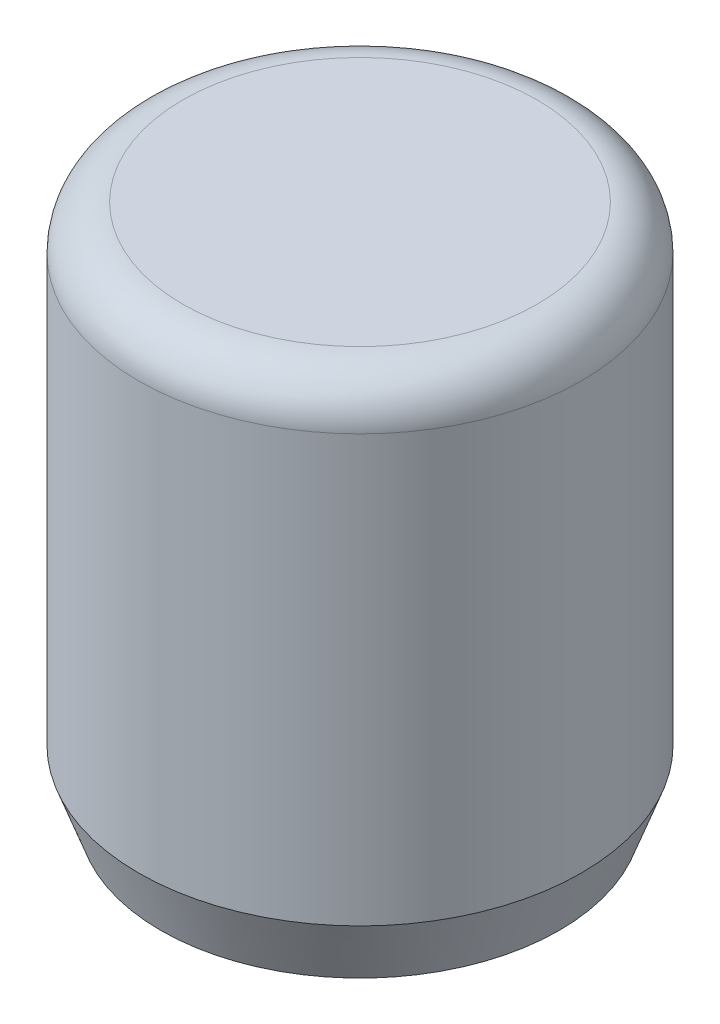
ISO-10303-21;
HEADER;
FILE_DESCRIPTION(('STEP AP214'),'2;1');
FILE_NAME('part.step','',(''),(''),'','','');
FILE_SCHEMA(('AUTOMOTIVE_DESIGN { 1 0 10303 214 1 1 1 1 }'));
ENDSEC;
DATA;
#1=APPLICATION_CONTEXT('core data for automotive mechanical design processes');
#2=APPLICATION_PROTOCOL_DEFINITION('international standard','automotive_design',2000,#1);
#3=PRODUCT_CONTEXT('',#1,'mechanical');
#4=PRODUCT('Part','Part','',(#3));
#5=PRODUCT_RELATED_PRODUCT_CATEGORY('part','',(#4));
#6=PRODUCT_DEFINITION_FORMATION('','',#4);
#7=PRODUCT_DEFINITION_CONTEXT('part definition',#1,'design');
#8=PRODUCT_DEFINITION('design','',#6,#7);
#9=PRODUCT_DEFINITION_SHAPE('','',#8);
#10=(LENGTH_UNIT() NAMED_UNIT(*) SI_UNIT(.MILLI.,.METRE.));
#11=(NAMED_UNIT(*) PLANE_ANGLE_UNIT() SI_UNIT($,.RADIAN.));
#12=(NAMED_UNIT(*) SI_UNIT($,.STERADIAN.) SOLID_ANGLE_UNIT());
#13=UNCERTAINTY_MEASURE_WITH_UNIT(LENGTH_MEASURE(1.E-05),#10,'distance_accuracy_value','');
#14=(GEOMETRIC_REPRESENTATION_CONTEXT(3) GLOBAL_UNCERTAINTY_ASSIGNED_CONTEXT((#13)) GLOBAL_UNIT_ASSIGNED_CONTEXT((#10,
#11,#12)) REPRESENTATION_CONTEXT('',''));
#15=CARTESIAN_POINT('',(0.,0.,0.));
#16=DIRECTION('',(0.,0.,1.));
#17=DIRECTION('',(1.,0.,0.));
#18=AXIS2_PLACEMENT_3D('',#15,#16,#17);
#19=CARTESIAN_POINT('',(0.,12.,0.));
#20=DIRECTION('',(0.,-1.,0.));
#21=DIRECTION('',(0.,0.,-1.));
#22=AXIS2_PLACEMENT_3D('',#19,#20,#21);
#23=CYLINDRICAL_SURFACE('',#22,5.);
#24=CARTESIAN_POINT('',(0.,1.3737387097273,0.));
#25=DIRECTION('',(0.,1.,0.));
#26=DIRECTION('',(0.,0.,1.));
#27=AXIS2_PLACEMENT_3D('',#24,#25,#26);
#28=CIRCLE('',#27,5.);
#29=CARTESIAN_POINT('',(0.,1.3737387097273,5.));
#30=VERTEX_POINT('',#29);
#31=EDGE_CURVE('E40',#30,#30,#28,.T.);
#32=ORIENTED_EDGE('',*,*,#31,.T.);
#33=EDGE_LOOP('',(#32));
#34=FACE_BOUND('',#33,.T.);
#35=CARTESIAN_POINT('',(0.,11.,0.));
#36=DIRECTION('',(0.,1.,0.));
#37=DIRECTION('',(0.,0.,1.));
#38=AXIS2_PLACEMENT_3D('',#35,#36,#37);
#39=CIRCLE('',#38,5.);
#40=CARTESIAN_POINT('',(0.,11.,5.));
#41=VERTEX_POINT('',#40);
#42=EDGE_CURVE('E44',#41,#41,#39,.F.);
#43=ORIENTED_EDGE('',*,*,#42,.T.);
#44=EDGE_LOOP('',(#43));
#45=FACE_BOUND('',#44,.T.);
#46=ADVANCED_FACE('F33',(#34,#45),#23,.T.);
#47=CARTESIAN_POINT('',(0.,12.,0.));
#48=DIRECTION('',(0.,1.,0.));
#49=DIRECTION('',(0.,0.,1.));
#50=AXIS2_PLACEMENT_3D('',#47,#48,#49);
#51=PLANE('',#50);
#52=CARTESIAN_POINT('',(0.,12.,0.));
#53=DIRECTION('',(0.,1.,0.));
#54=DIRECTION('',(0.,0.,1.));
#55=AXIS2_PLACEMENT_3D('',#52,#53,#54);
#56=CIRCLE('',#55,4.);
#57=CARTESIAN_POINT('',(0.,12.,4.));
#58=VERTEX_POINT('',#57);
#59=EDGE_CURVE('E48',#58,#58,#56,.T.);
#60=ORIENTED_EDGE('',*,*,#59,.T.);
#61=EDGE_LOOP('',(#60));
#62=FACE_BOUND('',#61,.T.);
#63=ADVANCED_FACE('F70',(#62),#51,.T.);
#64=CARTESIAN_POINT('',(0.,0.,0.));
#65=DIRECTION('',(0.,1.,0.));
#66=DIRECTION('',(0.,0.,1.));
#67=AXIS2_PLACEMENT_3D('',#64,#65,#66);
#68=PLANE('',#67);
#69=CARTESIAN_POINT('',(0.,0.,0.));
#70=DIRECTION('',(0.,1.,0.));
#71=DIRECTION('',(0.,0.,1.));
#72=AXIS2_PLACEMENT_3D('',#69,#70,#71);
#73=CIRCLE('',#72,4.5);
#74=CARTESIAN_POINT('',(0.,0.,4.5));
#75=VERTEX_POINT('',#74);
#76=EDGE_CURVE('E10',#75,#75,#73,.F.);
#77=ORIENTED_EDGE('',*,*,#76,.T.);
#78=EDGE_LOOP('',(#77));
#79=FACE_BOUND('',#78,.T.);
#80=CARTESIAN_POINT('',(0.,0.,0.));
#81=DIRECTION('',(0.,-1.,0.));
#82=DIRECTION('',(0.,0.,-1.));
#83=AXIS2_PLACEMENT_3D('',#80,#81,#82);
#84=CIRCLE('',#83,3.);
#85=CARTESIAN_POINT('',(0.,0.,-3.));
#86=VERTEX_POINT('',#85);
#87=EDGE_CURVE('E54',#86,#86,#84,.T.);
#88=ORIENTED_EDGE('',*,*,#87,.F.);
#89=EDGE_LOOP('',(#88));
#90=FACE_BOUND('',#89,.T.);
#91=ADVANCED_FACE('F65',(#79,#90),#68,.F.);
#92=CARTESIAN_POINT('',(0.,6.,0.));
#93=DIRECTION('',(0.,-1.,0.));
#94=DIRECTION('',(0.,0.,-1.));
#95=AXIS2_PLACEMENT_3D('',#92,#93,#94);
#96=CYLINDRICAL_SURFACE('',#95,3.);
#97=CARTESIAN_POINT('',(0.,6.,0.));
#98=DIRECTION('',(0.,-1.,0.));
#99=DIRECTION('',(0.,0.,-1.));
#100=AXIS2_PLACEMENT_3D('',#97,#98,#99);
#101=CIRCLE('',#100,3.);
#102=CARTESIAN_POINT('',(0.,6.,-3.));
#103=VERTEX_POINT('',#102);
#104=EDGE_CURVE('E53',#103,#103,#101,.T.);
#105=ORIENTED_EDGE('',*,*,#104,.F.);
#106=EDGE_LOOP('',(#105));
#107=FACE_BOUND('',#106,.T.);
#108=ORIENTED_EDGE('',*,*,#87,.T.);
#109=EDGE_LOOP('',(#108));
#110=FACE_BOUND('',#109,.T.);
#111=ADVANCED_FACE('F62',(#107,#110),#96,.F.);
#112=CARTESIAN_POINT('',(0.,6.,0.));
#113=DIRECTION('',(0.,-1.,0.));
#114=DIRECTION('',(0.,0.,-1.));
#115=AXIS2_PLACEMENT_3D('',#112,#113,#114);
#116=PLANE('',#115);
#117=ORIENTED_EDGE('',*,*,#104,.T.);
#118=EDGE_LOOP('',(#117));
#119=FACE_BOUND('',#118,.T.);
#120=ADVANCED_FACE('F60',(#119),#116,.T.);
#121=CARTESIAN_POINT('',(0.,11.,0.));
#122=DIRECTION('',(0.,1.,0.));
#123=DIRECTION('',(0.,0.,1.));
#124=AXIS2_PLACEMENT_3D('',#121,#122,#123);
#125=TOROIDAL_SURFACE('',#124,4.,1.);
#126=ORIENTED_EDGE('',*,*,#42,.F.);
#127=EDGE_LOOP('',(#126));
#128=FACE_BOUND('',#127,.T.);
#129=ORIENTED_EDGE('',*,*,#59,.F.);
#130=EDGE_LOOP('',(#129));
#131=FACE_BOUND('',#130,.T.);
#132=ADVANCED_FACE('F82',(#128,#131),#125,.T.);
#133=CARTESIAN_POINT('',(0.,1.3737387097273,0.));
#134=DIRECTION('',(0.,1.,0.));
#135=DIRECTION('',(0.,0.,1.));
#136=AXIS2_PLACEMENT_3D('',#133,#134,#135);
#137=CONICAL_SURFACE('',#136,5.,0.349065850398866);
#138=ORIENTED_EDGE('',*,*,#76,.F.);
#139=EDGE_LOOP('',(#138));
#140=FACE_BOUND('',#139,.T.);
#141=ORIENTED_EDGE('',*,*,#31,.F.);
#142=EDGE_LOOP('',(#141));
#143=FACE_BOUND('',#142,.T.);
#144=ADVANCED_FACE('F35',(#140,#143),#137,.T.);
#145=CLOSED_SHELL('',(#46,#63,#91,#111,#120,#132,#144));
#146=MANIFOLD_SOLID_BREP('B2',#145);
#147=ADVANCED_BREP_SHAPE_REPRESENTATION('',(#18,#146),#14);
#148=SHAPE_DEFINITION_REPRESENTATION(#9,#147);
ENDSEC;
END-ISO-10303-21;
